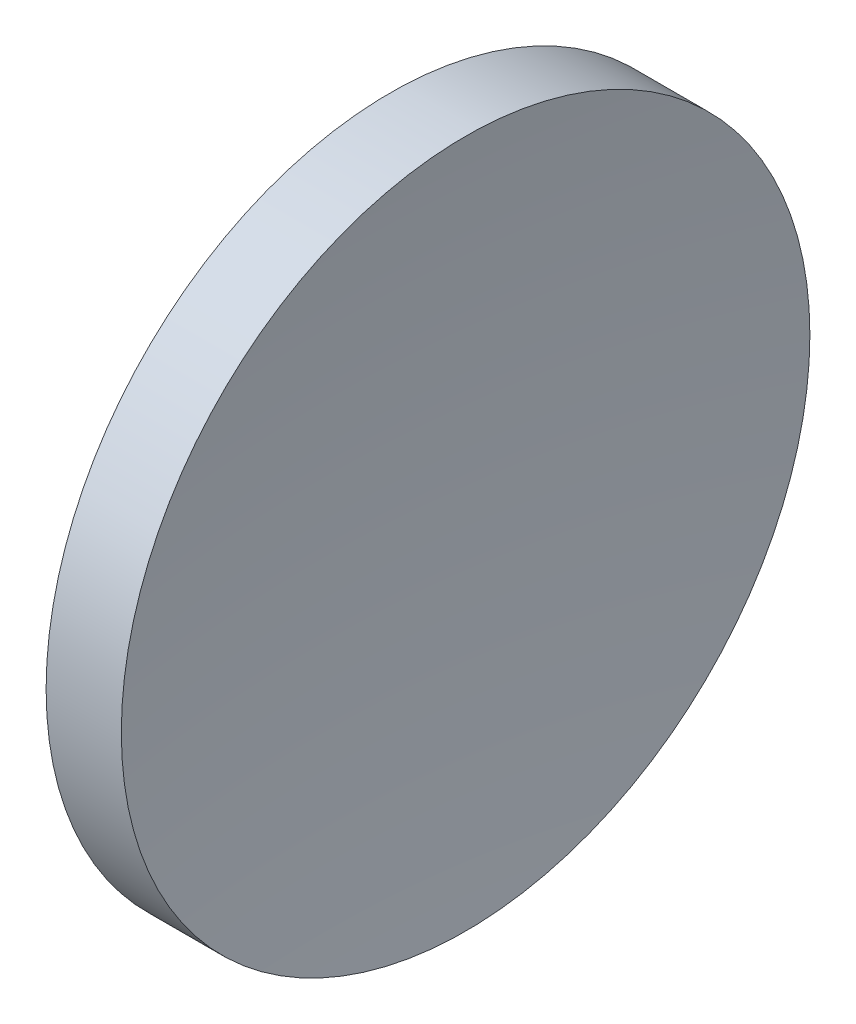
ISO-10303-21;
HEADER;
FILE_DESCRIPTION(('STEP AP214'),'2;1');
FILE_NAME('part.step','',(''),(''),'','','');
FILE_SCHEMA(('AUTOMOTIVE_DESIGN { 1 0 10303 214 1 1 1 1 }'));
ENDSEC;
DATA;
#1=APPLICATION_CONTEXT('core data for automotive mechanical design processes');
#2=APPLICATION_PROTOCOL_DEFINITION('international standard','automotive_design',2000,#1);
#3=PRODUCT_CONTEXT('',#1,'mechanical');
#4=PRODUCT('Part','Part','',(#3));
#5=PRODUCT_RELATED_PRODUCT_CATEGORY('part','',(#4));
#6=PRODUCT_DEFINITION_FORMATION('','',#4);
#7=PRODUCT_DEFINITION_CONTEXT('part definition',#1,'design');
#8=PRODUCT_DEFINITION('design','',#6,#7);
#9=PRODUCT_DEFINITION_SHAPE('','',#8);
#10=(LENGTH_UNIT() NAMED_UNIT(*) SI_UNIT(.MILLI.,.METRE.));
#11=(NAMED_UNIT(*) PLANE_ANGLE_UNIT() SI_UNIT($,.RADIAN.));
#12=(NAMED_UNIT(*) SI_UNIT($,.STERADIAN.) SOLID_ANGLE_UNIT());
#13=UNCERTAINTY_MEASURE_WITH_UNIT(LENGTH_MEASURE(1.E-05),#10,'distance_accuracy_value','');
#14=(GEOMETRIC_REPRESENTATION_CONTEXT(3) GLOBAL_UNCERTAINTY_ASSIGNED_CONTEXT((#13)) GLOBAL_UNIT_ASSIGNED_CONTEXT((#10,
#11,#12)) REPRESENTATION_CONTEXT('',''));
#15=CARTESIAN_POINT('',(0.,0.,0.));
#16=DIRECTION('',(0.,0.,1.));
#17=DIRECTION('',(1.,0.,0.));
#18=AXIS2_PLACEMENT_3D('',#15,#16,#17);
#19=CARTESIAN_POINT('',(226.70682663787,71.1939890865937,-0.0398316341729127));
#20=DIRECTION('',(0.,-1.,0.));
#21=DIRECTION('',(0.,0.,1.));
#22=AXIS2_PLACEMENT_3D('',#19,#20,#21);
#23=CIRCLE('',#22,105.200000000002);
#24=TRIMMED_CURVE('',#23,(PARAMETER_VALUE(-1.57041769908459)),
(PARAMETER_VALUE(1.57041769908459)),.T.,.PARAMETER.);
#25=CARTESIAN_POINT('',(226.70682663787,71.1939890865937,0.));
#26=DIRECTION('',(-1.,0.,0.));
#27=AXIS1_PLACEMENT('',#25,#26);
#28=SURFACE_OF_REVOLUTION('',#24,#27);
#29=CARTESIAN_POINT('',(122.281079382064,71.1939890865937,0.));
#30=DIRECTION('',(-1.,0.,0.));
#31=DIRECTION('',(0.,0.,1.));
#32=AXIS2_PLACEMENT_3D('',#29,#30,#31);
#33=CIRCLE('',#32,12.7);
#34=CARTESIAN_POINT('',(122.281079382064,71.1939890865937,12.7));
#35=VERTEX_POINT('',#34);
#36=EDGE_CURVE('E11',#35,#35,#33,.T.);
#37=ORIENTED_EDGE('',*,*,#36,.F.);
#38=EDGE_LOOP('',(#37));
#39=FACE_BOUND('',#38,.T.);
#40=CARTESIAN_POINT('',(121.506834178548,71.1939890865937,0.));
#41=VERTEX_POINT('',#40);
#42=VERTEX_LOOP('',#41);
#43=FACE_BOUND('',#42,.T.);
#44=ADVANCED_FACE('F37',(#39,#43),#28,.F.);
#45=CARTESIAN_POINT('',(111.955229757561,71.1939890865937,0.));
#46=DIRECTION('',(-1.,0.,0.));
#47=DIRECTION('',(0.,0.,1.));
#48=AXIS2_PLACEMENT_3D('',#45,#46,#47);
#49=CYLINDRICAL_SURFACE('',#48,12.7);
#50=CARTESIAN_POINT('',(119.506834178548,71.1939890865937,0.));
#51=DIRECTION('',(-1.,0.,0.));
#52=DIRECTION('',(0.,0.,1.));
#53=AXIS2_PLACEMENT_3D('',#50,#51,#52);
#54=CIRCLE('',#53,12.7);
#55=CARTESIAN_POINT('',(119.506834178548,71.1939890865937,12.7));
#56=VERTEX_POINT('',#55);
#57=EDGE_CURVE('E43',#56,#56,#54,.T.);
#58=ORIENTED_EDGE('',*,*,#57,.F.);
#59=EDGE_LOOP('',(#58));
#60=FACE_BOUND('',#59,.T.);
#61=ORIENTED_EDGE('',*,*,#36,.T.);
#62=EDGE_LOOP('',(#61));
#63=FACE_BOUND('',#62,.T.);
#64=ADVANCED_FACE('F47',(#60,#63),#49,.T.);
#65=CARTESIAN_POINT('',(119.506834178548,71.1939890865937,0.));
#66=DIRECTION('',(1.,0.,0.));
#67=DIRECTION('',(0.,0.,-1.));
#68=AXIS2_PLACEMENT_3D('',#65,#66,#67);
#69=PLANE('',#68);
#70=ORIENTED_EDGE('',*,*,#57,.T.);
#71=EDGE_LOOP('',(#70));
#72=FACE_BOUND('',#71,.T.);
#73=ADVANCED_FACE('F52',(#72),#69,.F.);
#74=CLOSED_SHELL('',(#44,#64,#73));
#75=MANIFOLD_SOLID_BREP('B2',#74);
#76=ADVANCED_BREP_SHAPE_REPRESENTATION('',(#18,#75),#14);
#77=SHAPE_DEFINITION_REPRESENTATION(#9,#76);
ENDSEC;
END-ISO-10303-21;
